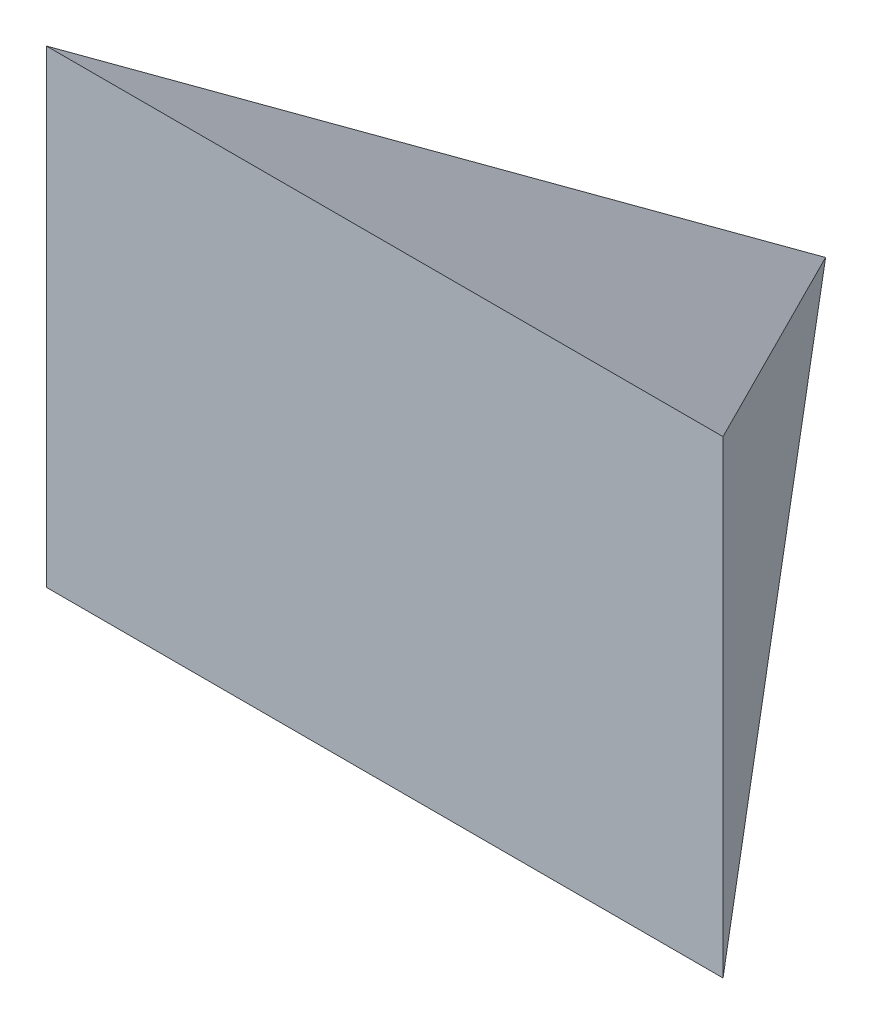
ISO-10303-21;
HEADER;
FILE_DESCRIPTION(('STEP AP214'),'2;1');
FILE_NAME('part.step','',(''),(''),'','','');
FILE_SCHEMA(('AUTOMOTIVE_DESIGN { 1 0 10303 214 1 1 1 1 }'));
ENDSEC;
DATA;
#1=APPLICATION_CONTEXT('core data for automotive mechanical design processes');
#2=APPLICATION_PROTOCOL_DEFINITION('international standard','automotive_design',2000,#1);
#3=PRODUCT_CONTEXT('',#1,'mechanical');
#4=PRODUCT('Part','Part','',(#3));
#5=PRODUCT_RELATED_PRODUCT_CATEGORY('part','',(#4));
#6=PRODUCT_DEFINITION_FORMATION('','',#4);
#7=PRODUCT_DEFINITION_CONTEXT('part definition',#1,'design');
#8=PRODUCT_DEFINITION('design','',#6,#7);
#9=PRODUCT_DEFINITION_SHAPE('','',#8);
#10=(LENGTH_UNIT() NAMED_UNIT(*) SI_UNIT(.MILLI.,.METRE.));
#11=(NAMED_UNIT(*) PLANE_ANGLE_UNIT() SI_UNIT($,.RADIAN.));
#12=(NAMED_UNIT(*) SI_UNIT($,.STERADIAN.) SOLID_ANGLE_UNIT());
#13=UNCERTAINTY_MEASURE_WITH_UNIT(LENGTH_MEASURE(1.E-05),#10,'distance_accuracy_value','');
#14=(GEOMETRIC_REPRESENTATION_CONTEXT(3) GLOBAL_UNCERTAINTY_ASSIGNED_CONTEXT((#13)) GLOBAL_UNIT_ASSIGNED_CONTEXT((#10,
#11,#12)) REPRESENTATION_CONTEXT('',''));
#15=CARTESIAN_POINT('',(0.,0.,0.));
#16=DIRECTION('',(0.,0.,1.));
#17=DIRECTION('',(1.,0.,0.));
#18=AXIS2_PLACEMENT_3D('',#15,#16,#17);
#19=CARTESIAN_POINT('',(153.465397595791,250.,200.));
#20=DIRECTION('',(-0.793353340291236,0.,0.608761429008719));
#21=DIRECTION('',(0.608761429008719,0.,0.793353340291236));
#22=AXIS2_PLACEMENT_3D('',#19,#20,#21);
#23=PLANE('',#22);
#24=DIRECTION('',(0.56089930863644,-0.388668008927864,0.730978210624102));
#25=VECTOR('',#24,1.);
#26=CARTESIAN_POINT('',(103.032029496831,53.6052716704512,134.273955055595));
#27=LINE('',#26,#25);
#28=CARTESIAN_POINT('',(0.,125.,0.));
#29=VERTEX_POINT('',#28);
#30=CARTESIAN_POINT('',(153.465397595791,18.6581136677049,200.));
#31=VERTEX_POINT('',#30);
#32=EDGE_CURVE('E65',#29,#31,#27,.T.);
#33=ORIENTED_EDGE('',*,*,#32,.F.);
#34=DIRECTION('',(-0.56089930863644,-0.388668008927864,-0.730978210624102));
#35=VECTOR('',#34,1.);
#36=CARTESIAN_POINT('',(157.532933871016,234.160433620536,205.300916478825));
#37=LINE('',#36,#35);
#38=CARTESIAN_POINT('',(153.465397595791,231.341886332295,200.));
#39=VERTEX_POINT('',#38);
#40=EDGE_CURVE('E79',#39,#29,#37,.T.);
#41=ORIENTED_EDGE('',*,*,#40,.F.);
#42=DIRECTION('',(0.,-1.,0.));
#43=VECTOR('',#42,1.);
#44=CARTESIAN_POINT('',(153.465397595791,250.,200.));
#45=LINE('',#44,#43);
#46=EDGE_CURVE('E43',#39,#31,#45,.T.);
#47=ORIENTED_EDGE('',*,*,#46,.T.);
#48=EDGE_LOOP('',(#33,#41,#47));
#49=FACE_BOUND('',#48,.T.);
#50=ADVANCED_FACE('F36',(#49),#23,.F.);
#51=CARTESIAN_POINT('',(0.,250.,0.));
#52=DIRECTION('',(0.793353340291236,0.,0.608761429008719));
#53=DIRECTION('',(0.608761429008719,0.,-0.793353340291236));
#54=AXIS2_PLACEMENT_3D('',#51,#52,#53);
#55=PLANE('',#54);
#56=DIRECTION('',(0.56089930863644,0.388668008927864,-0.730978210624102));
#57=VECTOR('',#56,1.);
#58=CARTESIAN_POINT('',(27.2504521870925,143.882852645494,-35.5134807116153));
#59=LINE('',#58,#57);
#60=CARTESIAN_POINT('',(-153.465397595791,18.6581136677049,200.));
#61=VERTEX_POINT('',#60);
#62=EDGE_CURVE('E58',#61,#29,#59,.T.);
#63=ORIENTED_EDGE('',*,*,#62,.F.);
#64=DIRECTION('',(0.,-1.,0.));
#65=VECTOR('',#64,1.);
#66=CARTESIAN_POINT('',(-153.465397595791,250.,200.));
#67=LINE('',#66,#65);
#68=CARTESIAN_POINT('',(-153.465397595791,231.341886332295,200.));
#69=VERTEX_POINT('',#68);
#70=EDGE_CURVE('E12',#69,#61,#67,.T.);
#71=ORIENTED_EDGE('',*,*,#70,.F.);
#72=DIRECTION('',(-0.56089930863644,0.388668008927864,0.730978210624102));
#73=VECTOR('',#72,1.);
#74=CARTESIAN_POINT('',(-27.2504521870926,143.882852645494,35.5134807116153));
#75=LINE('',#74,#73);
#76=EDGE_CURVE('E50',#29,#69,#75,.T.);
#77=ORIENTED_EDGE('',*,*,#76,.F.);
#78=EDGE_LOOP('',(#63,#71,#77));
#79=FACE_BOUND('',#78,.T.);
#80=ADVANCED_FACE('F86',(#79),#55,.F.);
#81=CARTESIAN_POINT('',(-153.465397595791,250.,200.));
#82=DIRECTION('',(0.,0.,-1.));
#83=DIRECTION('',(-1.,0.,0.));
#84=AXIS2_PLACEMENT_3D('',#81,#82,#83);
#85=PLANE('',#84);
#86=DIRECTION('',(1.,0.,0.));
#87=VECTOR('',#86,1.);
#88=CARTESIAN_POINT('',(-153.465397595791,18.6581136677049,200.));
#89=LINE('',#88,#87);
#90=EDGE_CURVE('E68',#61,#31,#89,.T.);
#91=ORIENTED_EDGE('',*,*,#90,.T.);
#92=ORIENTED_EDGE('',*,*,#46,.F.);
#93=DIRECTION('',(1.,0.,0.));
#94=VECTOR('',#93,1.);
#95=CARTESIAN_POINT('',(-153.465397595791,231.341886332295,200.));
#96=LINE('',#95,#94);
#97=EDGE_CURVE('E77',#69,#39,#96,.T.);
#98=ORIENTED_EDGE('',*,*,#97,.F.);
#99=ORIENTED_EDGE('',*,*,#70,.T.);
#100=EDGE_LOOP('',(#91,#92,#98,#99));
#101=FACE_BOUND('',#100,.T.);
#102=ADVANCED_FACE('F75',(#101),#85,.F.);
#103=CARTESIAN_POINT('',(-153.465397595791,125.,0.));
#104=DIRECTION('',(0.,0.882947592858928,-0.469471562785889));
#105=DIRECTION('',(0.,0.469471562785889,0.882947592858928));
#106=AXIS2_PLACEMENT_3D('',#103,#104,#105);
#107=PLANE('',#106);
#108=ORIENTED_EDGE('',*,*,#40,.T.);
#109=ORIENTED_EDGE('',*,*,#76,.T.);
#110=ORIENTED_EDGE('',*,*,#97,.T.);
#111=EDGE_LOOP('',(#108,#109,#110));
#112=FACE_BOUND('',#111,.T.);
#113=ADVANCED_FACE('F84',(#112),#107,.T.);
#114=CARTESIAN_POINT('',(-153.465397595791,18.6581136677049,200.));
#115=DIRECTION('',(0.,-0.882947592858928,-0.469471562785888));
#116=DIRECTION('',(0.,0.469471562785888,-0.882947592858928));
#117=AXIS2_PLACEMENT_3D('',#114,#115,#116);
#118=PLANE('',#117);
#119=ORIENTED_EDGE('',*,*,#32,.T.);
#120=ORIENTED_EDGE('',*,*,#90,.F.);
#121=ORIENTED_EDGE('',*,*,#62,.T.);
#122=EDGE_LOOP('',(#119,#120,#121));
#123=FACE_BOUND('',#122,.T.);
#124=ADVANCED_FACE('F67',(#123),#118,.T.);
#125=CLOSED_SHELL('',(#50,#80,#102,#113,#124));
#126=MANIFOLD_SOLID_BREP('B2',#125);
#127=ADVANCED_BREP_SHAPE_REPRESENTATION('',(#18,#126),#14);
#128=SHAPE_DEFINITION_REPRESENTATION(#9,#127);
ENDSEC;
END-ISO-10303-21;
